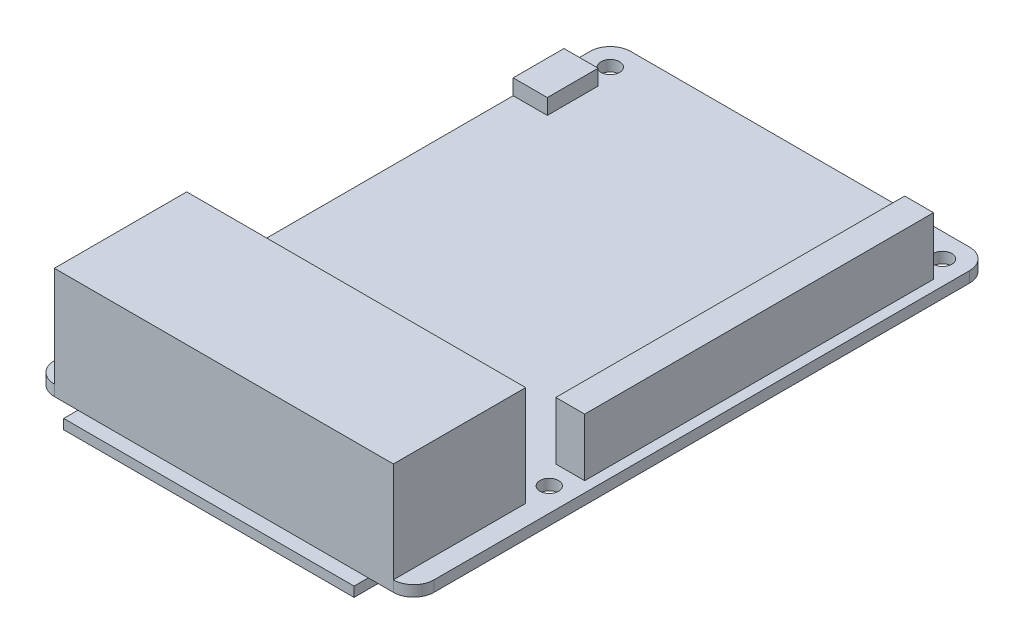
ISO-10303-21;
HEADER;
FILE_DESCRIPTION(('STEP AP214'),'2;1');
FILE_NAME('part.step','',(''),(''),'','','');
FILE_SCHEMA(('AUTOMOTIVE_DESIGN { 1 0 10303 214 1 1 1 1 }'));
ENDSEC;
DATA;
#1=APPLICATION_CONTEXT('core data for automotive mechanical design processes');
#2=APPLICATION_PROTOCOL_DEFINITION('international standard','automotive_design',2000,#1);
#3=PRODUCT_CONTEXT('',#1,'mechanical');
#4=PRODUCT('Part','Part','',(#3));
#5=PRODUCT_RELATED_PRODUCT_CATEGORY('part','',(#4));
#6=PRODUCT_DEFINITION_FORMATION('','',#4);
#7=PRODUCT_DEFINITION_CONTEXT('part definition',#1,'design');
#8=PRODUCT_DEFINITION('design','',#6,#7);
#9=PRODUCT_DEFINITION_SHAPE('','',#8);
#10=(LENGTH_UNIT() NAMED_UNIT(*) SI_UNIT(.MILLI.,.METRE.));
#11=(NAMED_UNIT(*) PLANE_ANGLE_UNIT() SI_UNIT($,.RADIAN.));
#12=(NAMED_UNIT(*) SI_UNIT($,.STERADIAN.) SOLID_ANGLE_UNIT());
#13=UNCERTAINTY_MEASURE_WITH_UNIT(LENGTH_MEASURE(1.E-05),#10,'distance_accuracy_value','');
#14=(GEOMETRIC_REPRESENTATION_CONTEXT(3) GLOBAL_UNCERTAINTY_ASSIGNED_CONTEXT((#13)) GLOBAL_UNIT_ASSIGNED_CONTEXT((#10,
#11,#12)) REPRESENTATION_CONTEXT('',''));
#15=CARTESIAN_POINT('',(0.,0.,0.));
#16=DIRECTION('',(0.,0.,1.));
#17=DIRECTION('',(1.,0.,0.));
#18=AXIS2_PLACEMENT_3D('',#15,#16,#17);
#19=CARTESIAN_POINT('',(0.,3.88620000000001,-78.1674));
#20=DIRECTION('',(1.,0.,0.));
#21=DIRECTION('',(0.,0.,-1.));
#22=AXIS2_PLACEMENT_3D('',#19,#20,#21);
#23=PLANE('',#22);
#24=DIRECTION('',(0.,0.,1.));
#25=VECTOR('',#24,1.);
#26=CARTESIAN_POINT('',(0.,1.60020000000001,-78.1674));
#27=LINE('',#26,#25);
#28=CARTESIAN_POINT('',(0.,1.60020000000001,-78.1674));
#29=VERTEX_POINT('',#28);
#30=CARTESIAN_POINT('',(0.,1.60020000000001,-70.6744));
#31=VERTEX_POINT('',#30);
#32=EDGE_CURVE('E107',#29,#31,#27,.T.);
#33=ORIENTED_EDGE('',*,*,#32,.T.);
#34=DIRECTION('',(0.,-0.999999999999999,0.));
#35=VECTOR('',#34,1.);
#36=CARTESIAN_POINT('',(0.,3.88620000000001,-70.6744));
#37=LINE('',#36,#35);
#38=CARTESIAN_POINT('',(0.,3.88620000000001,-70.6744));
#39=VERTEX_POINT('',#38);
#40=EDGE_CURVE('E12',#39,#31,#37,.T.);
#41=ORIENTED_EDGE('',*,*,#40,.F.);
#42=DIRECTION('',(0.,0.,1.));
#43=VECTOR('',#42,1.);
#44=CARTESIAN_POINT('',(0.,3.88620000000001,-78.1674));
#45=LINE('',#44,#43);
#46=CARTESIAN_POINT('',(0.,3.88620000000001,-78.1674));
#47=VERTEX_POINT('',#46);
#48=EDGE_CURVE('E95',#47,#39,#45,.T.);
#49=ORIENTED_EDGE('',*,*,#48,.F.);
#50=DIRECTION('',(0.,-0.999999999999999,0.));
#51=VECTOR('',#50,1.);
#52=CARTESIAN_POINT('',(0.,3.88620000000001,-78.1674));
#53=LINE('',#52,#51);
#54=EDGE_CURVE('E103',#47,#29,#53,.T.);
#55=ORIENTED_EDGE('',*,*,#54,.T.);
#56=EDGE_LOOP('',(#33,#41,#49,#55));
#57=FACE_BOUND('',#56,.T.);
#58=ADVANCED_FACE('F44',(#57),#23,.F.);
#59=CARTESIAN_POINT('',(0.,3.88620000000001,-70.6744));
#60=DIRECTION('',(0.,0.,-1.));
#61=DIRECTION('',(-1.,0.,0.));
#62=AXIS2_PLACEMENT_3D('',#59,#60,#61);
#63=PLANE('',#62);
#64=DIRECTION('',(1.,0.,0.));
#65=VECTOR('',#64,1.);
#66=CARTESIAN_POINT('',(0.,1.60020000000001,-70.6744));
#67=LINE('',#66,#65);
#68=CARTESIAN_POINT('',(5.03292757481331,1.60020000000001,-70.6744));
#69=VERTEX_POINT('',#68);
#70=EDGE_CURVE('E99',#31,#69,#67,.T.);
#71=ORIENTED_EDGE('',*,*,#70,.T.);
#72=DIRECTION('',(0.,-0.999999999999999,0.));
#73=VECTOR('',#72,1.);
#74=CARTESIAN_POINT('',(5.03292757481331,3.88620000000001,-70.6744));
#75=LINE('',#74,#73);
#76=CARTESIAN_POINT('',(5.03292757481331,3.88620000000001,-70.6744));
#77=VERTEX_POINT('',#76);
#78=EDGE_CURVE('E52',#77,#69,#75,.T.);
#79=ORIENTED_EDGE('',*,*,#78,.F.);
#80=DIRECTION('',(1.,0.,0.));
#81=VECTOR('',#80,1.);
#82=CARTESIAN_POINT('',(0.,3.88620000000001,-70.6744));
#83=LINE('',#82,#81);
#84=EDGE_CURVE('E90',#39,#77,#83,.T.);
#85=ORIENTED_EDGE('',*,*,#84,.F.);
#86=ORIENTED_EDGE('',*,*,#40,.T.);
#87=EDGE_LOOP('',(#71,#79,#85,#86));
#88=FACE_BOUND('',#87,.T.);
#89=ADVANCED_FACE('F98',(#88),#63,.F.);
#90=CARTESIAN_POINT('',(5.03292757481331,3.88620000000001,-78.1674));
#91=DIRECTION('',(-1.,0.,0.));
#92=DIRECTION('',(0.,0.,1.));
#93=AXIS2_PLACEMENT_3D('',#90,#91,#92);
#94=PLANE('',#93);
#95=DIRECTION('',(0.,0.,-1.));
#96=VECTOR('',#95,1.);
#97=CARTESIAN_POINT('',(5.03292757481331,1.60020000000001,-78.1674));
#98=LINE('',#97,#96);
#99=CARTESIAN_POINT('',(5.03292757481331,1.60020000000001,-78.1674));
#100=VERTEX_POINT('',#99);
#101=EDGE_CURVE('E77',#69,#100,#98,.T.);
#102=ORIENTED_EDGE('',*,*,#101,.T.);
#103=DIRECTION('',(0.,-0.999999999999999,0.));
#104=VECTOR('',#103,1.);
#105=CARTESIAN_POINT('',(5.03292757481331,3.88620000000001,-78.1674));
#106=LINE('',#105,#104);
#107=CARTESIAN_POINT('',(5.03292757481331,3.88620000000001,-78.1674));
#108=VERTEX_POINT('',#107);
#109=EDGE_CURVE('E100',#108,#100,#106,.T.);
#110=ORIENTED_EDGE('',*,*,#109,.F.);
#111=DIRECTION('',(0.,0.,-1.));
#112=VECTOR('',#111,1.);
#113=CARTESIAN_POINT('',(5.03292757481331,3.88620000000001,-78.1674));
#114=LINE('',#113,#112);
#115=EDGE_CURVE('E93',#77,#108,#114,.T.);
#116=ORIENTED_EDGE('',*,*,#115,.F.);
#117=ORIENTED_EDGE('',*,*,#78,.T.);
#118=EDGE_LOOP('',(#102,#110,#116,#117));
#119=FACE_BOUND('',#118,.T.);
#120=ADVANCED_FACE('F101',(#119),#94,.F.);
#121=CARTESIAN_POINT('',(0.,3.88620000000001,-78.1674));
#122=DIRECTION('',(0.,0.,1.));
#123=DIRECTION('',(1.,0.,0.));
#124=AXIS2_PLACEMENT_3D('',#121,#122,#123);
#125=PLANE('',#124);
#126=DIRECTION('',(-1.,0.,0.));
#127=VECTOR('',#126,1.);
#128=CARTESIAN_POINT('',(0.,1.60020000000001,-78.1674));
#129=LINE('',#128,#127);
#130=EDGE_CURVE('E83',#100,#29,#129,.T.);
#131=ORIENTED_EDGE('',*,*,#130,.T.);
#132=ORIENTED_EDGE('',*,*,#54,.F.);
#133=DIRECTION('',(-1.,0.,0.));
#134=VECTOR('',#133,1.);
#135=CARTESIAN_POINT('',(0.,3.88620000000001,-78.1674));
#136=LINE('',#135,#134);
#137=EDGE_CURVE('E60',#108,#47,#136,.T.);
#138=ORIENTED_EDGE('',*,*,#137,.F.);
#139=ORIENTED_EDGE('',*,*,#109,.T.);
#140=EDGE_LOOP('',(#131,#132,#138,#139));
#141=FACE_BOUND('',#140,.T.);
#142=ADVANCED_FACE('F114',(#141),#125,.F.);
#143=CARTESIAN_POINT('',(0.,3.88620000000001,0.));
#144=DIRECTION('',(0.,0.999999999999999,0.));
#145=DIRECTION('',(0.,0.,1.));
#146=AXIS2_PLACEMENT_3D('',#143,#144,#145);
#147=PLANE('',#146);
#148=ORIENTED_EDGE('',*,*,#48,.T.);
#149=ORIENTED_EDGE('',*,*,#84,.T.);
#150=ORIENTED_EDGE('',*,*,#115,.T.);
#151=ORIENTED_EDGE('',*,*,#137,.T.);
#152=EDGE_LOOP('',(#148,#149,#150,#151));
#153=FACE_BOUND('',#152,.T.);
#154=ADVANCED_FACE('F91',(#153),#147,.T.);
#155=CARTESIAN_POINT('',(0.,1.6002,0.));
#156=DIRECTION('',(0.,0.999999999999999,0.));
#157=DIRECTION('',(0.,0.,1.));
#158=AXIS2_PLACEMENT_3D('',#155,#156,#157);
#159=PLANE('',#158);
#160=ORIENTED_EDGE('',*,*,#32,.F.);
#161=ORIENTED_EDGE('',*,*,#130,.F.);
#162=ORIENTED_EDGE('',*,*,#101,.F.);
#163=ORIENTED_EDGE('',*,*,#70,.F.);
#164=EDGE_LOOP('',(#160,#161,#162,#163));
#165=FACE_BOUND('',#164,.T.);
#166=ADVANCED_FACE('F117',(#165),#159,.F.);
#167=CLOSED_SHELL('',(#58,#89,#120,#142,#154,#166));
#168=MANIFOLD_SOLID_BREP('B2',#167);
#169=CARTESIAN_POINT('',(2.99999999999999,1.60020000000001,-81.9999999999999));
#170=DIRECTION('',(0.,-0.999999999999999,0.));
#171=DIRECTION('',(0.,0.,-1.));
#172=AXIS2_PLACEMENT_3D('',#169,#170,#171);
#173=PLANE('',#172);
#174=DIRECTION('',(0.,0.,1.));
#175=VECTOR('',#174,1.);
#176=CARTESIAN_POINT('',(3.00000000000002,1.6002,0.));
#177=LINE('',#176,#175);
#178=CARTESIAN_POINT('',(3.00000000000002,1.60020000000001,-19.5171453212591));
#179=VERTEX_POINT('',#178);
#180=CARTESIAN_POINT('',(3.00000000000002,1.6002,0.));
#181=VERTEX_POINT('',#180);
#182=EDGE_CURVE('E363',#179,#181,#177,.T.);
#183=ORIENTED_EDGE('',*,*,#182,.F.);
#184=DIRECTION('',(-1.,0.,0.));
#185=VECTOR('',#184,1.);
#186=CARTESIAN_POINT('',(3.00000000000002,1.60020000000001,-19.5171453212591));
#187=LINE('',#186,#185);
#188=CARTESIAN_POINT('',(53.,1.6002,-19.5171453212591));
#189=VERTEX_POINT('',#188);
#190=EDGE_CURVE('E368',#189,#179,#187,.T.);
#191=ORIENTED_EDGE('',*,*,#190,.F.);
#192=DIRECTION('',(0.,0.,-1.));
#193=VECTOR('',#192,1.);
#194=CARTESIAN_POINT('',(53.,1.60020000000001,0.));
#195=LINE('',#194,#193);
#196=CARTESIAN_POINT('',(53.,1.60020000000001,0.));
#197=VERTEX_POINT('',#196);
#198=EDGE_CURVE('E377',#197,#189,#195,.T.);
#199=ORIENTED_EDGE('',*,*,#198,.F.);
#200=CARTESIAN_POINT('',(53.,1.60020000000001,-3.));
#201=DIRECTION('',(0.,0.999999999999999,0.));
#202=DIRECTION('',(0.,0.,1.));
#203=AXIS2_PLACEMENT_3D('',#200,#201,#202);
#204=CIRCLE('',#203,3.);
#205=CARTESIAN_POINT('',(56.,1.60020000000001,-3.));
#206=VERTEX_POINT('',#205);
#207=EDGE_CURVE('E426',#197,#206,#204,.T.);
#208=ORIENTED_EDGE('',*,*,#207,.T.);
#209=DIRECTION('',(0.,0.,-1.));
#210=VECTOR('',#209,1.);
#211=CARTESIAN_POINT('',(56.,1.60020000000001,-3.));
#212=LINE('',#211,#210);
#213=CARTESIAN_POINT('',(56.,1.6002,-81.9999999999999));
#214=VERTEX_POINT('',#213);
#215=EDGE_CURVE('E428',#206,#214,#212,.T.);
#216=ORIENTED_EDGE('',*,*,#215,.T.);
#217=CARTESIAN_POINT('',(53.,1.6002,-81.9999999999999));
#218=DIRECTION('',(0.,0.999999999999999,0.));
#219=DIRECTION('',(0.,0.,-1.));
#220=AXIS2_PLACEMENT_3D('',#217,#218,#219);
#221=CIRCLE('',#220,3.);
#222=CARTESIAN_POINT('',(53.,1.6002,-85.));
#223=VERTEX_POINT('',#222);
#224=EDGE_CURVE('E430',#214,#223,#221,.T.);
#225=ORIENTED_EDGE('',*,*,#224,.T.);
#226=DIRECTION('',(-1.,0.,0.));
#227=VECTOR('',#226,1.);
#228=CARTESIAN_POINT('',(2.99999999999999,1.6002,-85.));
#229=LINE('',#228,#227);
#230=CARTESIAN_POINT('',(2.99999999999999,1.6002,-85.));
#231=VERTEX_POINT('',#230);
#232=EDGE_CURVE('E432',#223,#231,#229,.T.);
#233=ORIENTED_EDGE('',*,*,#232,.T.);
#234=CARTESIAN_POINT('',(2.99999999999999,1.60020000000001,-81.9999999999999));
#235=DIRECTION('',(0.,0.999999999999999,0.));
#236=DIRECTION('',(0.,0.,-1.));
#237=AXIS2_PLACEMENT_3D('',#234,#235,#236);
#238=CIRCLE('',#237,3.);
#239=CARTESIAN_POINT('',(0.,1.60020000000001,-81.9999999999999));
#240=VERTEX_POINT('',#239);
#241=EDGE_CURVE('E418',#231,#240,#238,.T.);
#242=ORIENTED_EDGE('',*,*,#241,.T.);
#243=DIRECTION('',(0.,0.,1.));
#244=VECTOR('',#243,1.);
#245=CARTESIAN_POINT('',(0.,1.6002,-3.00000000000002));
#246=LINE('',#245,#244);
#247=CARTESIAN_POINT('',(0.,1.6002,-3.00000000000002));
#248=VERTEX_POINT('',#247);
#249=EDGE_CURVE('E421',#240,#248,#246,.T.);
#250=ORIENTED_EDGE('',*,*,#249,.T.);
#251=CARTESIAN_POINT('',(3.,1.6002,-3.));
#252=DIRECTION('',(0.,0.999999999999999,0.));
#253=DIRECTION('',(0.,0.,-1.));
#254=AXIS2_PLACEMENT_3D('',#251,#252,#253);
#255=CIRCLE('',#254,3.);
#256=EDGE_CURVE('E424',#248,#181,#255,.T.);
#257=ORIENTED_EDGE('',*,*,#256,.T.);
#258=EDGE_LOOP('',(#183,#191,#199,#208,#216,#225,#233,#242,#250,#257));
#259=FACE_BOUND('',#258,.T.);
#260=CARTESIAN_POINT('',(3.49999999999999,1.60020000000001,-81.4999999999999));
#261=DIRECTION('',(0.,0.999999999999999,0.));
#262=DIRECTION('',(0.,0.,1.));
#263=AXIS2_PLACEMENT_3D('',#260,#261,#262);
#264=CIRCLE('',#263,1.375);
#265=CARTESIAN_POINT('',(3.49999999999999,1.60020000000001,-80.1249999999999));
#266=VERTEX_POINT('',#265);
#267=EDGE_CURVE('E393',#266,#266,#264,.T.);
#268=ORIENTED_EDGE('',*,*,#267,.F.);
#269=EDGE_LOOP('',(#268));
#270=FACE_BOUND('',#269,.T.);
#271=CARTESIAN_POINT('',(3.49999999999999,1.60020000000001,-23.5));
#272=DIRECTION('',(0.,0.999999999999999,0.));
#273=DIRECTION('',(0.,0.,1.));
#274=AXIS2_PLACEMENT_3D('',#271,#272,#273);
#275=CIRCLE('',#274,1.375);
#276=CARTESIAN_POINT('',(3.49999999999999,1.60020000000001,-22.125));
#277=VERTEX_POINT('',#276);
#278=EDGE_CURVE('E399',#277,#277,#275,.T.);
#279=ORIENTED_EDGE('',*,*,#278,.F.);
#280=EDGE_LOOP('',(#279));
#281=FACE_BOUND('',#280,.T.);
#282=CARTESIAN_POINT('',(52.5,1.6002,-81.4999999999999));
#283=DIRECTION('',(0.,0.999999999999999,0.));
#284=DIRECTION('',(0.,0.,1.));
#285=AXIS2_PLACEMENT_3D('',#282,#283,#284);
#286=CIRCLE('',#285,1.375);
#287=CARTESIAN_POINT('',(52.5,1.6002,-80.1249999999999));
#288=VERTEX_POINT('',#287);
#289=EDGE_CURVE('E405',#288,#288,#286,.T.);
#290=ORIENTED_EDGE('',*,*,#289,.F.);
#291=EDGE_LOOP('',(#290));
#292=FACE_BOUND('',#291,.T.);
#293=CARTESIAN_POINT('',(52.5,1.6002,-23.5));
#294=DIRECTION('',(0.,0.999999999999999,0.));
#295=DIRECTION('',(0.,0.,1.));
#296=AXIS2_PLACEMENT_3D('',#293,#294,#295);
#297=CIRCLE('',#296,1.375);
#298=CARTESIAN_POINT('',(52.5,1.6002,-22.125));
#299=VERTEX_POINT('',#298);
#300=EDGE_CURVE('E411',#299,#299,#297,.T.);
#301=ORIENTED_EDGE('',*,*,#300,.F.);
#302=EDGE_LOOP('',(#301));
#303=FACE_BOUND('',#302,.T.);
#304=DIRECTION('',(0.,0.,-0.999999999999999));
#305=VECTOR('',#304,1.);
#306=CARTESIAN_POINT('',(54.4480020123617,1.6002,-26.7705763978723));
#307=LINE('',#306,#305);
#308=CARTESIAN_POINT('',(54.4480020123617,1.6002,-26.7705763978723));
#309=VERTEX_POINT('',#308);
#310=CARTESIAN_POINT('',(54.4480020123617,1.6002,-78.2268075319821));
#311=VERTEX_POINT('',#310);
#312=EDGE_CURVE('E326',#309,#311,#307,.T.);
#313=ORIENTED_EDGE('',*,*,#312,.F.);
#314=DIRECTION('',(1.,0.,0.));
#315=VECTOR('',#314,1.);
#316=CARTESIAN_POINT('',(54.4480020123617,1.6002,-26.7705763978723));
#317=LINE('',#316,#315);
#318=CARTESIAN_POINT('',(50.191282161852,1.6002,-26.7705763978723));
#319=VERTEX_POINT('',#318);
#320=EDGE_CURVE('E323',#319,#309,#317,.T.);
#321=ORIENTED_EDGE('',*,*,#320,.F.);
#322=DIRECTION('',(0.,0.,0.999999999999999));
#323=VECTOR('',#322,1.);
#324=CARTESIAN_POINT('',(50.191282161852,1.6002,-26.7705763978723));
#325=LINE('',#324,#323);
#326=CARTESIAN_POINT('',(50.191282161852,1.6002,-78.2268075319821));
#327=VERTEX_POINT('',#326);
#328=EDGE_CURVE('E189',#327,#319,#325,.T.);
#329=ORIENTED_EDGE('',*,*,#328,.F.);
#330=DIRECTION('',(-1.,0.,0.));
#331=VECTOR('',#330,1.);
#332=CARTESIAN_POINT('',(54.4480020123617,1.6002,-78.2268075319821));
#333=LINE('',#332,#331);
#334=EDGE_CURVE('E184',#311,#327,#333,.T.);
#335=ORIENTED_EDGE('',*,*,#334,.F.);
#336=EDGE_LOOP('',(#313,#321,#329,#335));
#337=FACE_BOUND('',#336,.T.);
#338=ADVANCED_FACE('F167',(#259,#270,#281,#292,#303,#337),#173,.F.);
#339=CARTESIAN_POINT('',(2.99999999999999,1.60020000000001,-81.9999999999999));
#340=DIRECTION('',(0.,-0.999999999999999,0.));
#341=DIRECTION('',(0.,0.,-1.));
#342=AXIS2_PLACEMENT_3D('',#339,#340,#341);
#343=CYLINDRICAL_SURFACE('',#342,3.);
#344=CARTESIAN_POINT('',(2.99999999999999,0.,-81.9999999999999));
#345=DIRECTION('',(0.,0.999999999999999,0.));
#346=DIRECTION('',(0.,0.,-1.));
#347=AXIS2_PLACEMENT_3D('',#344,#345,#346);
#348=CIRCLE('',#347,3.);
#349=CARTESIAN_POINT('',(2.99999999999999,0.,-85.));
#350=VERTEX_POINT('',#349);
#351=CARTESIAN_POINT('',(0.,0.,-81.9999999999999));
#352=VERTEX_POINT('',#351);
#353=EDGE_CURVE('E417',#350,#352,#348,.T.);
#354=ORIENTED_EDGE('',*,*,#353,.T.);
#355=DIRECTION('',(0.,-0.999999999999999,0.));
#356=VECTOR('',#355,1.);
#357=CARTESIAN_POINT('',(0.,1.60020000000001,-81.9999999999999));
#358=LINE('',#357,#356);
#359=EDGE_CURVE('E171',#240,#352,#358,.T.);
#360=ORIENTED_EDGE('',*,*,#359,.F.);
#361=ORIENTED_EDGE('',*,*,#241,.F.);
#362=DIRECTION('',(0.,-0.999999999999999,0.));
#363=VECTOR('',#362,1.);
#364=CARTESIAN_POINT('',(2.99999999999999,1.6002,-85.));
#365=LINE('',#364,#363);
#366=EDGE_CURVE('E434',#231,#350,#365,.T.);
#367=ORIENTED_EDGE('',*,*,#366,.T.);
#368=EDGE_LOOP('',(#354,#360,#361,#367));
#369=FACE_BOUND('',#368,.T.);
#370=ADVANCED_FACE('F169',(#369),#343,.T.);
#371=CARTESIAN_POINT('',(0.,1.6002,-3.00000000000002));
#372=DIRECTION('',(1.,0.,0.));
#373=DIRECTION('',(0.,0.,-1.));
#374=AXIS2_PLACEMENT_3D('',#371,#372,#373);
#375=PLANE('',#374);
#376=DIRECTION('',(0.,0.,1.));
#377=VECTOR('',#376,1.);
#378=CARTESIAN_POINT('',(0.,0.,-3.00000000000002));
#379=LINE('',#378,#377);
#380=CARTESIAN_POINT('',(0.,0.,-3.00000000000002));
#381=VERTEX_POINT('',#380);
#382=EDGE_CURVE('E437',#352,#381,#379,.T.);
#383=ORIENTED_EDGE('',*,*,#382,.T.);
#384=DIRECTION('',(0.,-0.999999999999999,0.));
#385=VECTOR('',#384,1.);
#386=CARTESIAN_POINT('',(0.,1.6002,-3.00000000000002));
#387=LINE('',#386,#385);
#388=EDGE_CURVE('E469',#248,#381,#387,.T.);
#389=ORIENTED_EDGE('',*,*,#388,.F.);
#390=ORIENTED_EDGE('',*,*,#249,.F.);
#391=ORIENTED_EDGE('',*,*,#359,.T.);
#392=EDGE_LOOP('',(#383,#389,#390,#391));
#393=FACE_BOUND('',#392,.T.);
#394=ADVANCED_FACE('F478',(#393),#375,.F.);
#395=CARTESIAN_POINT('',(3.,1.6002,-3.));
#396=DIRECTION('',(0.,-0.999999999999999,0.));
#397=DIRECTION('',(0.,0.,-1.));
#398=AXIS2_PLACEMENT_3D('',#395,#396,#397);
#399=CYLINDRICAL_SURFACE('',#398,3.);
#400=CARTESIAN_POINT('',(3.,0.,-3.));
#401=DIRECTION('',(0.,0.999999999999999,0.));
#402=DIRECTION('',(0.,0.,-1.));
#403=AXIS2_PLACEMENT_3D('',#400,#401,#402);
#404=CIRCLE('',#403,3.);
#405=CARTESIAN_POINT('',(3.00000000000002,0.,0.));
#406=VERTEX_POINT('',#405);
#407=EDGE_CURVE('E439',#381,#406,#404,.T.);
#408=ORIENTED_EDGE('',*,*,#407,.T.);
#409=DIRECTION('',(0.,-0.999999999999999,0.));
#410=VECTOR('',#409,1.);
#411=CARTESIAN_POINT('',(3.00000000000002,1.6002,0.));
#412=LINE('',#411,#410);
#413=EDGE_CURVE('E467',#181,#406,#412,.T.);
#414=ORIENTED_EDGE('',*,*,#413,.F.);
#415=ORIENTED_EDGE('',*,*,#256,.F.);
#416=ORIENTED_EDGE('',*,*,#388,.T.);
#417=EDGE_LOOP('',(#408,#414,#415,#416));
#418=FACE_BOUND('',#417,.T.);
#419=ADVANCED_FACE('F490',(#418),#399,.T.);
#420=CARTESIAN_POINT('',(3.00000000000002,1.6002,0.));
#421=DIRECTION('',(0.,0.,-1.));
#422=DIRECTION('',(-1.,0.,0.));
#423=AXIS2_PLACEMENT_3D('',#420,#421,#422);
#424=PLANE('',#423);
#425=DIRECTION('',(1.,0.,0.));
#426=VECTOR('',#425,1.);
#427=CARTESIAN_POINT('',(3.00000000000002,0.,0.));
#428=LINE('',#427,#426);
#429=CARTESIAN_POINT('',(6.46826940659455,0.,0.));
#430=VERTEX_POINT('',#429);
#431=EDGE_CURVE('E442',#406,#430,#428,.T.);
#432=ORIENTED_EDGE('',*,*,#431,.T.);
#433=CARTESIAN_POINT('',(49.3032950653712,0.,0.));
#434=VERTEX_POINT('',#433);
#435=EDGE_CURVE('E446',#430,#434,#428,.T.);
#436=ORIENTED_EDGE('',*,*,#435,.T.);
#437=CARTESIAN_POINT('',(53.,0.,0.));
#438=VERTEX_POINT('',#437);
#439=EDGE_CURVE('E441',#434,#438,#428,.T.);
#440=ORIENTED_EDGE('',*,*,#439,.T.);
#441=DIRECTION('',(0.,-0.999999999999999,0.));
#442=VECTOR('',#441,1.);
#443=CARTESIAN_POINT('',(53.,1.60020000000001,0.));
#444=LINE('',#443,#442);
#445=EDGE_CURVE('E464',#197,#438,#444,.T.);
#446=ORIENTED_EDGE('',*,*,#445,.F.);
#447=DIRECTION('',(0.,-0.999999999999999,0.));
#448=VECTOR('',#447,1.);
#449=CARTESIAN_POINT('',(53.,16.4002,0.));
#450=LINE('',#449,#448);
#451=CARTESIAN_POINT('',(53.,16.4002,0.));
#452=VERTEX_POINT('',#451);
#453=EDGE_CURVE('E387',#452,#197,#450,.T.);
#454=ORIENTED_EDGE('',*,*,#453,.F.);
#455=DIRECTION('',(1.,0.,0.));
#456=VECTOR('',#455,1.);
#457=CARTESIAN_POINT('',(3.00000000000002,16.4002,0.));
#458=LINE('',#457,#456);
#459=CARTESIAN_POINT('',(3.00000000000002,16.4002,0.));
#460=VERTEX_POINT('',#459);
#461=EDGE_CURVE('E367',#460,#452,#458,.T.);
#462=ORIENTED_EDGE('',*,*,#461,.F.);
#463=DIRECTION('',(0.,-0.999999999999999,0.));
#464=VECTOR('',#463,1.);
#465=CARTESIAN_POINT('',(3.00000000000002,16.4002,0.));
#466=LINE('',#465,#464);
#467=EDGE_CURVE('E390',#460,#181,#466,.T.);
#468=ORIENTED_EDGE('',*,*,#467,.T.);
#469=ORIENTED_EDGE('',*,*,#413,.T.);
#470=EDGE_LOOP('',(#432,#436,#440,#446,#454,#462,#468,#469));
#471=FACE_BOUND('',#470,.T.);
#472=ADVANCED_FACE('F492',(#471),#424,.F.);
#473=CARTESIAN_POINT('',(53.,1.60020000000001,-3.));
#474=DIRECTION('',(0.,-0.999999999999999,0.));
#475=DIRECTION('',(0.,0.,-1.));
#476=AXIS2_PLACEMENT_3D('',#473,#474,#475);
#477=CYLINDRICAL_SURFACE('',#476,3.);
#478=CARTESIAN_POINT('',(53.,0.,-3.));
#479=DIRECTION('',(0.,0.999999999999999,0.));
#480=DIRECTION('',(0.,0.,1.));
#481=AXIS2_PLACEMENT_3D('',#478,#479,#480);
#482=CIRCLE('',#481,3.);
#483=CARTESIAN_POINT('',(56.,0.,-3.));
#484=VERTEX_POINT('',#483);
#485=EDGE_CURVE('E445',#438,#484,#482,.T.);
#486=ORIENTED_EDGE('',*,*,#485,.T.);
#487=DIRECTION('',(0.,-0.999999999999999,0.));
#488=VECTOR('',#487,1.);
#489=CARTESIAN_POINT('',(56.,1.60020000000001,-3.));
#490=LINE('',#489,#488);
#491=EDGE_CURVE('E461',#206,#484,#490,.T.);
#492=ORIENTED_EDGE('',*,*,#491,.F.);
#493=ORIENTED_EDGE('',*,*,#207,.F.);
#494=ORIENTED_EDGE('',*,*,#445,.T.);
#495=EDGE_LOOP('',(#486,#492,#493,#494));
#496=FACE_BOUND('',#495,.T.);
#497=ADVANCED_FACE('F515',(#496),#477,.T.);
#498=CARTESIAN_POINT('',(56.,1.60020000000001,-3.));
#499=DIRECTION('',(-1.,0.,0.));
#500=DIRECTION('',(0.,0.,1.));
#501=AXIS2_PLACEMENT_3D('',#498,#499,#500);
#502=PLANE('',#501);
#503=DIRECTION('',(0.,0.,-1.));
#504=VECTOR('',#503,1.);
#505=CARTESIAN_POINT('',(56.,0.,-3.));
#506=LINE('',#505,#504);
#507=CARTESIAN_POINT('',(56.,0.,-81.9999999999999));
#508=VERTEX_POINT('',#507);
#509=EDGE_CURVE('E448',#484,#508,#506,.T.);
#510=ORIENTED_EDGE('',*,*,#509,.T.);
#511=DIRECTION('',(0.,-0.999999999999999,0.));
#512=VECTOR('',#511,1.);
#513=CARTESIAN_POINT('',(56.,1.6002,-81.9999999999999));
#514=LINE('',#513,#512);
#515=EDGE_CURVE('E458',#214,#508,#514,.T.);
#516=ORIENTED_EDGE('',*,*,#515,.F.);
#517=ORIENTED_EDGE('',*,*,#215,.F.);
#518=ORIENTED_EDGE('',*,*,#491,.T.);
#519=EDGE_LOOP('',(#510,#516,#517,#518));
#520=FACE_BOUND('',#519,.T.);
#521=ADVANCED_FACE('F520',(#520),#502,.F.);
#522=CARTESIAN_POINT('',(53.,1.6002,-81.9999999999999));
#523=DIRECTION('',(0.,-0.999999999999999,0.));
#524=DIRECTION('',(0.,0.,-1.));
#525=AXIS2_PLACEMENT_3D('',#522,#523,#524);
#526=CYLINDRICAL_SURFACE('',#525,3.);
#527=CARTESIAN_POINT('',(53.,0.,-81.9999999999999));
#528=DIRECTION('',(0.,0.999999999999999,0.));
#529=DIRECTION('',(0.,0.,-1.));
#530=AXIS2_PLACEMENT_3D('',#527,#528,#529);
#531=CIRCLE('',#530,3.);
#532=CARTESIAN_POINT('',(53.,0.,-85.));
#533=VERTEX_POINT('',#532);
#534=EDGE_CURVE('E450',#508,#533,#531,.T.);
#535=ORIENTED_EDGE('',*,*,#534,.T.);
#536=DIRECTION('',(0.,-0.999999999999999,0.));
#537=VECTOR('',#536,1.);
#538=CARTESIAN_POINT('',(53.,1.6002,-85.));
#539=LINE('',#538,#537);
#540=EDGE_CURVE('E455',#223,#533,#539,.T.);
#541=ORIENTED_EDGE('',*,*,#540,.F.);
#542=ORIENTED_EDGE('',*,*,#224,.F.);
#543=ORIENTED_EDGE('',*,*,#515,.T.);
#544=EDGE_LOOP('',(#535,#541,#542,#543));
#545=FACE_BOUND('',#544,.T.);
#546=ADVANCED_FACE('F525',(#545),#526,.T.);
#547=CARTESIAN_POINT('',(2.99999999999999,1.6002,-85.));
#548=DIRECTION('',(0.,0.,1.));
#549=DIRECTION('',(1.,0.,0.));
#550=AXIS2_PLACEMENT_3D('',#547,#548,#549);
#551=PLANE('',#550);
#552=DIRECTION('',(-1.,0.,0.));
#553=VECTOR('',#552,1.);
#554=CARTESIAN_POINT('',(2.99999999999999,0.,-85.));
#555=LINE('',#554,#553);
#556=EDGE_CURVE('E422',#533,#350,#555,.T.);
#557=ORIENTED_EDGE('',*,*,#556,.T.);
#558=ORIENTED_EDGE('',*,*,#366,.F.);
#559=ORIENTED_EDGE('',*,*,#232,.F.);
#560=ORIENTED_EDGE('',*,*,#540,.T.);
#561=EDGE_LOOP('',(#557,#558,#559,#560));
#562=FACE_BOUND('',#561,.T.);
#563=ADVANCED_FACE('F527',(#562),#551,.F.);
#564=CARTESIAN_POINT('',(2.99999999999999,0.,-81.9999999999999));
#565=DIRECTION('',(0.,-0.999999999999999,0.));
#566=DIRECTION('',(0.,0.,-1.));
#567=AXIS2_PLACEMENT_3D('',#564,#565,#566);
#568=PLANE('',#567);
#569=DIRECTION('',(0.,0.,-1.));
#570=VECTOR('',#569,1.);
#571=CARTESIAN_POINT('',(6.46826940659454,0.,-80.1435865954223));
#572=LINE('',#571,#570);
#573=CARTESIAN_POINT('',(6.46826940659454,0.,-80.1435865954223));
#574=VERTEX_POINT('',#573);
#575=EDGE_CURVE('E42',#430,#574,#572,.T.);
#576=ORIENTED_EDGE('',*,*,#575,.F.);
#577=ORIENTED_EDGE('',*,*,#431,.F.);
#578=ORIENTED_EDGE('',*,*,#407,.F.);
#579=ORIENTED_EDGE('',*,*,#382,.F.);
#580=ORIENTED_EDGE('',*,*,#353,.F.);
#581=ORIENTED_EDGE('',*,*,#556,.F.);
#582=ORIENTED_EDGE('',*,*,#534,.F.);
#583=ORIENTED_EDGE('',*,*,#509,.F.);
#584=ORIENTED_EDGE('',*,*,#485,.F.);
#585=ORIENTED_EDGE('',*,*,#439,.F.);
#586=DIRECTION('',(0.,0.,1.));
#587=VECTOR('',#586,1.);
#588=CARTESIAN_POINT('',(49.3032950653712,0.,-80.1435865954223));
#589=LINE('',#588,#587);
#590=CARTESIAN_POINT('',(49.3032950653712,0.,-80.1435865954223));
#591=VERTEX_POINT('',#590);
#592=EDGE_CURVE('E348',#591,#434,#589,.T.);
#593=ORIENTED_EDGE('',*,*,#592,.F.);
#594=DIRECTION('',(1.,0.,0.));
#595=VECTOR('',#594,1.);
#596=CARTESIAN_POINT('',(6.46826940659454,0.,-80.1435865954223));
#597=LINE('',#596,#595);
#598=EDGE_CURVE('E329',#574,#591,#597,.T.);
#599=ORIENTED_EDGE('',*,*,#598,.F.);
#600=EDGE_LOOP('',(#576,#577,#578,#579,#580,#581,#582,#583,#584,#585,#593,#599));
#601=FACE_BOUND('',#600,.T.);
#602=CARTESIAN_POINT('',(3.49999999999999,0.,-81.4999999999999));
#603=DIRECTION('',(0.,0.999999999999999,0.));
#604=DIRECTION('',(0.,0.,1.));
#605=AXIS2_PLACEMENT_3D('',#602,#603,#604);
#606=CIRCLE('',#605,1.375);
#607=CARTESIAN_POINT('',(3.49999999999999,0.,-80.1249999999999));
#608=VERTEX_POINT('',#607);
#609=EDGE_CURVE('E396',#608,#608,#606,.T.);
#610=ORIENTED_EDGE('',*,*,#609,.T.);
#611=EDGE_LOOP('',(#610));
#612=FACE_BOUND('',#611,.T.);
#613=CARTESIAN_POINT('',(3.49999999999999,0.,-23.5));
#614=DIRECTION('',(0.,0.999999999999999,0.));
#615=DIRECTION('',(0.,0.,1.));
#616=AXIS2_PLACEMENT_3D('',#613,#614,#615);
#617=CIRCLE('',#616,1.375);
#618=CARTESIAN_POINT('',(3.49999999999999,0.,-22.125));
#619=VERTEX_POINT('',#618);
#620=EDGE_CURVE('E402',#619,#619,#617,.T.);
#621=ORIENTED_EDGE('',*,*,#620,.T.);
#622=EDGE_LOOP('',(#621));
#623=FACE_BOUND('',#622,.T.);
#624=CARTESIAN_POINT('',(52.5,0.,-81.4999999999999));
#625=DIRECTION('',(0.,0.999999999999999,0.));
#626=DIRECTION('',(0.,0.,1.));
#627=AXIS2_PLACEMENT_3D('',#624,#625,#626);
#628=CIRCLE('',#627,1.375);
#629=CARTESIAN_POINT('',(52.5,0.,-80.1249999999999));
#630=VERTEX_POINT('',#629);
#631=EDGE_CURVE('E408',#630,#630,#628,.T.);
#632=ORIENTED_EDGE('',*,*,#631,.T.);
#633=EDGE_LOOP('',(#632));
#634=FACE_BOUND('',#633,.T.);
#635=CARTESIAN_POINT('',(52.5,0.,-23.5));
#636=DIRECTION('',(0.,0.999999999999999,0.));
#637=DIRECTION('',(0.,0.,1.));
#638=AXIS2_PLACEMENT_3D('',#635,#636,#637);
#639=CIRCLE('',#638,1.375);
#640=CARTESIAN_POINT('',(52.5,0.,-22.125));
#641=VERTEX_POINT('',#640);
#642=EDGE_CURVE('E414',#641,#641,#639,.T.);
#643=ORIENTED_EDGE('',*,*,#642,.T.);
#644=EDGE_LOOP('',(#643));
#645=FACE_BOUND('',#644,.T.);
#646=ADVANCED_FACE('F485',(#601,#612,#623,#634,#645),#568,.T.);
#647=CARTESIAN_POINT('',(52.5,1.6002,-23.5));
#648=DIRECTION('',(0.,0.999999999999999,0.));
#649=DIRECTION('',(0.,0.,1.));
#650=AXIS2_PLACEMENT_3D('',#647,#648,#649);
#651=CYLINDRICAL_SURFACE('',#650,1.375);
#652=ORIENTED_EDGE('',*,*,#642,.F.);
#653=EDGE_LOOP('',(#652));
#654=FACE_BOUND('',#653,.T.);
#655=ORIENTED_EDGE('',*,*,#300,.T.);
#656=EDGE_LOOP('',(#655));
#657=FACE_BOUND('',#656,.T.);
#658=ADVANCED_FACE('F534',(#654,#657),#651,.F.);
#659=CARTESIAN_POINT('',(52.5,1.6002,-81.4999999999999));
#660=DIRECTION('',(0.,0.999999999999999,0.));
#661=DIRECTION('',(0.,0.,1.));
#662=AXIS2_PLACEMENT_3D('',#659,#660,#661);
#663=CYLINDRICAL_SURFACE('',#662,1.375);
#664=ORIENTED_EDGE('',*,*,#631,.F.);
#665=EDGE_LOOP('',(#664));
#666=FACE_BOUND('',#665,.T.);
#667=ORIENTED_EDGE('',*,*,#289,.T.);
#668=EDGE_LOOP('',(#667));
#669=FACE_BOUND('',#668,.T.);
#670=ADVANCED_FACE('F545',(#666,#669),#663,.F.);
#671=CARTESIAN_POINT('',(3.49999999999999,1.60020000000001,-23.5));
#672=DIRECTION('',(0.,0.999999999999999,0.));
#673=DIRECTION('',(0.,0.,1.));
#674=AXIS2_PLACEMENT_3D('',#671,#672,#673);
#675=CYLINDRICAL_SURFACE('',#674,1.375);
#676=ORIENTED_EDGE('',*,*,#620,.F.);
#677=EDGE_LOOP('',(#676));
#678=FACE_BOUND('',#677,.T.);
#679=ORIENTED_EDGE('',*,*,#278,.T.);
#680=EDGE_LOOP('',(#679));
#681=FACE_BOUND('',#680,.T.);
#682=ADVANCED_FACE('F549',(#678,#681),#675,.F.);
#683=CARTESIAN_POINT('',(3.49999999999999,1.60020000000001,-81.4999999999999));
#684=DIRECTION('',(0.,0.999999999999999,0.));
#685=DIRECTION('',(0.,0.,1.));
#686=AXIS2_PLACEMENT_3D('',#683,#684,#685);
#687=CYLINDRICAL_SURFACE('',#686,1.375);
#688=ORIENTED_EDGE('',*,*,#609,.F.);
#689=EDGE_LOOP('',(#688));
#690=FACE_BOUND('',#689,.T.);
#691=ORIENTED_EDGE('',*,*,#267,.T.);
#692=EDGE_LOOP('',(#691));
#693=FACE_BOUND('',#692,.T.);
#694=ADVANCED_FACE('F553',(#690,#693),#687,.F.);
#695=CARTESIAN_POINT('',(3.00000000000002,16.4002,0.));
#696=DIRECTION('',(1.,0.,0.));
#697=DIRECTION('',(0.,0.,-1.));
#698=AXIS2_PLACEMENT_3D('',#695,#696,#697);
#699=PLANE('',#698);
#700=ORIENTED_EDGE('',*,*,#182,.T.);
#701=ORIENTED_EDGE('',*,*,#467,.F.);
#702=DIRECTION('',(0.,0.,1.));
#703=VECTOR('',#702,1.);
#704=CARTESIAN_POINT('',(3.00000000000002,16.4002,0.));
#705=LINE('',#704,#703);
#706=CARTESIAN_POINT('',(3.00000000000001,16.4002,-19.5171453212591));
#707=VERTEX_POINT('',#706);
#708=EDGE_CURVE('E364',#707,#460,#705,.T.);
#709=ORIENTED_EDGE('',*,*,#708,.F.);
#710=DIRECTION('',(0.,-0.999999999999999,0.));
#711=VECTOR('',#710,1.);
#712=CARTESIAN_POINT('',(3.00000000000001,16.4002,-19.5171453212591));
#713=LINE('',#712,#711);
#714=EDGE_CURVE('E374',#707,#179,#713,.T.);
#715=ORIENTED_EDGE('',*,*,#714,.T.);
#716=EDGE_LOOP('',(#700,#701,#709,#715));
#717=FACE_BOUND('',#716,.T.);
#718=ADVANCED_FACE('F499',(#717),#699,.F.);
#719=CARTESIAN_POINT('',(53.,16.4002,0.));
#720=DIRECTION('',(-1.,0.,0.));
#721=DIRECTION('',(0.,0.,1.));
#722=AXIS2_PLACEMENT_3D('',#719,#720,#721);
#723=PLANE('',#722);
#724=ORIENTED_EDGE('',*,*,#198,.T.);
#725=DIRECTION('',(0.,-0.999999999999999,0.));
#726=VECTOR('',#725,1.);
#727=CARTESIAN_POINT('',(53.,16.4002,-19.5171453212591));
#728=LINE('',#727,#726);
#729=CARTESIAN_POINT('',(53.,16.4002,-19.5171453212591));
#730=VERTEX_POINT('',#729);
#731=EDGE_CURVE('E384',#730,#189,#728,.T.);
#732=ORIENTED_EDGE('',*,*,#731,.F.);
#733=DIRECTION('',(0.,0.,-1.));
#734=VECTOR('',#733,1.);
#735=CARTESIAN_POINT('',(53.,16.4002,0.));
#736=LINE('',#735,#734);
#737=EDGE_CURVE('E370',#452,#730,#736,.T.);
#738=ORIENTED_EDGE('',*,*,#737,.F.);
#739=ORIENTED_EDGE('',*,*,#453,.T.);
#740=EDGE_LOOP('',(#724,#732,#738,#739));
#741=FACE_BOUND('',#740,.T.);
#742=ADVANCED_FACE('F509',(#741),#723,.F.);
#743=CARTESIAN_POINT('',(3.00000000000001,16.4002,-19.5171453212591));
#744=DIRECTION('',(0.,0.,1.));
#745=DIRECTION('',(1.,0.,0.));
#746=AXIS2_PLACEMENT_3D('',#743,#744,#745);
#747=PLANE('',#746);
#748=ORIENTED_EDGE('',*,*,#190,.T.);
#749=ORIENTED_EDGE('',*,*,#714,.F.);
#750=DIRECTION('',(-1.,0.,0.));
#751=VECTOR('',#750,1.);
#752=CARTESIAN_POINT('',(3.00000000000001,16.4002,-19.5171453212591));
#753=LINE('',#752,#751);
#754=EDGE_CURVE('E372',#730,#707,#753,.T.);
#755=ORIENTED_EDGE('',*,*,#754,.F.);
#756=ORIENTED_EDGE('',*,*,#731,.T.);
#757=EDGE_LOOP('',(#748,#749,#755,#756));
#758=FACE_BOUND('',#757,.T.);
#759=ADVANCED_FACE('F504',(#758),#747,.F.);
#760=CARTESIAN_POINT('',(0.,16.4002,0.));
#761=DIRECTION('',(0.,-0.999999999999999,0.));
#762=DIRECTION('',(0.,0.,-1.));
#763=AXIS2_PLACEMENT_3D('',#760,#761,#762);
#764=PLANE('',#763);
#765=ORIENTED_EDGE('',*,*,#708,.T.);
#766=ORIENTED_EDGE('',*,*,#461,.T.);
#767=ORIENTED_EDGE('',*,*,#737,.T.);
#768=ORIENTED_EDGE('',*,*,#754,.T.);
#769=EDGE_LOOP('',(#765,#766,#767,#768));
#770=FACE_BOUND('',#769,.T.);
#771=ADVANCED_FACE('F564',(#770),#764,.F.);
#772=CARTESIAN_POINT('',(0.,0.,0.));
#773=DIRECTION('',(0.,0.999999999999999,0.));
#774=DIRECTION('',(0.,0.,1.));
#775=AXIS2_PLACEMENT_3D('',#772,#773,#774);
#776=PLANE('',#775);
#777=ORIENTED_EDGE('',*,*,#435,.F.);
#778=CARTESIAN_POINT('',(6.46826940659454,0.,2.09999999999999));
#779=VERTEX_POINT('',#778);
#780=EDGE_CURVE('E177',#779,#430,#572,.T.);
#781=ORIENTED_EDGE('',*,*,#780,.F.);
#782=DIRECTION('',(-1.,0.,0.));
#783=VECTOR('',#782,1.);
#784=CARTESIAN_POINT('',(6.46826940659454,0.,2.09999999999999));
#785=LINE('',#784,#783);
#786=CARTESIAN_POINT('',(49.3032950653712,0.,2.09999999999999));
#787=VERTEX_POINT('',#786);
#788=EDGE_CURVE('E338',#787,#779,#785,.T.);
#789=ORIENTED_EDGE('',*,*,#788,.F.);
#790=EDGE_CURVE('E347',#434,#787,#589,.T.);
#791=ORIENTED_EDGE('',*,*,#790,.F.);
#792=EDGE_LOOP('',(#777,#781,#789,#791));
#793=FACE_BOUND('',#792,.T.);
#794=ADVANCED_FACE('F567',(#793),#776,.T.);
#795=CARTESIAN_POINT('',(6.46826940659453,-1.44779999999997,-80.1435865954223));
#796=DIRECTION('',(1.,0.,0.));
#797=DIRECTION('',(0.,0.,-1.));
#798=AXIS2_PLACEMENT_3D('',#795,#796,#797);
#799=PLANE('',#798);
#800=ORIENTED_EDGE('',*,*,#780,.T.);
#801=ORIENTED_EDGE('',*,*,#575,.T.);
#802=DIRECTION('',(0.,0.999999999999999,0.));
#803=VECTOR('',#802,1.);
#804=CARTESIAN_POINT('',(6.46826940659453,-1.44779999999997,-80.1435865954223));
#805=LINE('',#804,#803);
#806=CARTESIAN_POINT('',(6.46826940659453,-1.44779999999997,-80.1435865954223));
#807=VERTEX_POINT('',#806);
#808=EDGE_CURVE('E360',#807,#574,#805,.T.);
#809=ORIENTED_EDGE('',*,*,#808,.F.);
#810=DIRECTION('',(0.,0.,-1.));
#811=VECTOR('',#810,1.);
#812=CARTESIAN_POINT('',(6.46826940659453,-1.44779999999997,-80.1435865954223));
#813=LINE('',#812,#811);
#814=CARTESIAN_POINT('',(6.46826940659453,-1.4478,2.09999999999999));
#815=VERTEX_POINT('',#814);
#816=EDGE_CURVE('E334',#815,#807,#813,.T.);
#817=ORIENTED_EDGE('',*,*,#816,.F.);
#818=DIRECTION('',(0.,0.999999999999999,0.));
#819=VECTOR('',#818,1.);
#820=CARTESIAN_POINT('',(6.46826940659453,-1.4478,2.09999999999999));
#821=LINE('',#820,#819);
#822=EDGE_CURVE('E343',#815,#779,#821,.T.);
#823=ORIENTED_EDGE('',*,*,#822,.T.);
#824=EDGE_LOOP('',(#800,#801,#809,#817,#823));
#825=FACE_BOUND('',#824,.T.);
#826=ADVANCED_FACE('F569',(#825),#799,.F.);
#827=CARTESIAN_POINT('',(6.46826940659453,-1.44779999999997,-80.1435865954223));
#828=DIRECTION('',(0.,0.,1.));
#829=DIRECTION('',(1.,0.,0.));
#830=AXIS2_PLACEMENT_3D('',#827,#828,#829);
#831=PLANE('',#830);
#832=ORIENTED_EDGE('',*,*,#598,.T.);
#833=DIRECTION('',(0.,0.999999999999999,0.));
#834=VECTOR('',#833,1.);
#835=CARTESIAN_POINT('',(49.3032950653712,-1.4478,-80.1435865954223));
#836=LINE('',#835,#834);
#837=CARTESIAN_POINT('',(49.3032950653712,-1.4478,-80.1435865954223));
#838=VERTEX_POINT('',#837);
#839=EDGE_CURVE('E357',#838,#591,#836,.T.);
#840=ORIENTED_EDGE('',*,*,#839,.F.);
#841=DIRECTION('',(1.,0.,0.));
#842=VECTOR('',#841,1.);
#843=CARTESIAN_POINT('',(6.46826940659453,-1.44779999999997,-80.1435865954223));
#844=LINE('',#843,#842);
#845=EDGE_CURVE('E337',#807,#838,#844,.T.);
#846=ORIENTED_EDGE('',*,*,#845,.F.);
#847=ORIENTED_EDGE('',*,*,#808,.T.);
#848=EDGE_LOOP('',(#832,#840,#846,#847));
#849=FACE_BOUND('',#848,.T.);
#850=ADVANCED_FACE('F572',(#849),#831,.F.);
#851=CARTESIAN_POINT('',(49.3032950653712,-1.4478,-80.1435865954223));
#852=DIRECTION('',(-1.,0.,0.));
#853=DIRECTION('',(0.,0.,1.));
#854=AXIS2_PLACEMENT_3D('',#851,#852,#853);
#855=PLANE('',#854);
#856=ORIENTED_EDGE('',*,*,#592,.T.);
#857=ORIENTED_EDGE('',*,*,#790,.T.);
#858=DIRECTION('',(0.,0.999999999999999,0.));
#859=VECTOR('',#858,1.);
#860=CARTESIAN_POINT('',(49.3032950653712,-1.4478,2.09999999999999));
#861=LINE('',#860,#859);
#862=CARTESIAN_POINT('',(49.3032950653712,-1.4478,2.09999999999999));
#863=VERTEX_POINT('',#862);
#864=EDGE_CURVE('E354',#863,#787,#861,.T.);
#865=ORIENTED_EDGE('',*,*,#864,.F.);
#866=DIRECTION('',(0.,0.,1.));
#867=VECTOR('',#866,1.);
#868=CARTESIAN_POINT('',(49.3032950653712,-1.4478,-80.1435865954223));
#869=LINE('',#868,#867);
#870=EDGE_CURVE('E340',#838,#863,#869,.T.);
#871=ORIENTED_EDGE('',*,*,#870,.F.);
#872=ORIENTED_EDGE('',*,*,#839,.T.);
#873=EDGE_LOOP('',(#856,#857,#865,#871,#872));
#874=FACE_BOUND('',#873,.T.);
#875=ADVANCED_FACE('F576',(#874),#855,.F.);
#876=CARTESIAN_POINT('',(6.46826940659453,-1.4478,2.09999999999999));
#877=DIRECTION('',(0.,0.,-1.));
#878=DIRECTION('',(-1.,0.,0.));
#879=AXIS2_PLACEMENT_3D('',#876,#877,#878);
#880=PLANE('',#879);
#881=ORIENTED_EDGE('',*,*,#788,.T.);
#882=ORIENTED_EDGE('',*,*,#822,.F.);
#883=DIRECTION('',(-1.,0.,0.));
#884=VECTOR('',#883,1.);
#885=CARTESIAN_POINT('',(6.46826940659453,-1.4478,2.09999999999999));
#886=LINE('',#885,#884);
#887=EDGE_CURVE('E342',#863,#815,#886,.T.);
#888=ORIENTED_EDGE('',*,*,#887,.F.);
#889=ORIENTED_EDGE('',*,*,#864,.T.);
#890=EDGE_LOOP('',(#881,#882,#888,#889));
#891=FACE_BOUND('',#890,.T.);
#892=ADVANCED_FACE('F580',(#891),#880,.F.);
#893=CARTESIAN_POINT('',(0.,-1.4478,0.));
#894=DIRECTION('',(0.,0.999999999999999,0.));
#895=DIRECTION('',(0.,0.,1.));
#896=AXIS2_PLACEMENT_3D('',#893,#894,#895);
#897=PLANE('',#896);
#898=ORIENTED_EDGE('',*,*,#816,.T.);
#899=ORIENTED_EDGE('',*,*,#845,.T.);
#900=ORIENTED_EDGE('',*,*,#870,.T.);
#901=ORIENTED_EDGE('',*,*,#887,.T.);
#902=EDGE_LOOP('',(#898,#899,#900,#901));
#903=FACE_BOUND('',#902,.T.);
#904=ADVANCED_FACE('F584',(#903),#897,.F.);
#905=CARTESIAN_POINT('',(54.4480020123617,10.1092,-26.7705763978723));
#906=DIRECTION('',(-1.,0.,0.));
#907=DIRECTION('',(0.,0.,1.));
#908=AXIS2_PLACEMENT_3D('',#905,#906,#907);
#909=PLANE('',#908);
#910=ORIENTED_EDGE('',*,*,#312,.T.);
#911=DIRECTION('',(0.,-0.999999999999999,0.));
#912=VECTOR('',#911,1.);
#913=CARTESIAN_POINT('',(54.4480020123617,10.1092,-78.2268075319821));
#914=LINE('',#913,#912);
#915=CARTESIAN_POINT('',(54.4480020123617,10.1092,-78.2268075319821));
#916=VERTEX_POINT('',#915);
#917=EDGE_CURVE('E307',#916,#311,#914,.T.);
#918=ORIENTED_EDGE('',*,*,#917,.F.);
#919=DIRECTION('',(0.,0.,-0.999999999999999));
#920=VECTOR('',#919,1.);
#921=CARTESIAN_POINT('',(54.4480020123617,10.1092,-26.7705763978723));
#922=LINE('',#921,#920);
#923=CARTESIAN_POINT('',(54.4480020123617,10.1092,-26.7705763978723));
#924=VERTEX_POINT('',#923);
#925=EDGE_CURVE('E314',#924,#916,#922,.T.);
#926=ORIENTED_EDGE('',*,*,#925,.F.);
#927=DIRECTION('',(0.,-0.999999999999999,0.));
#928=VECTOR('',#927,1.);
#929=CARTESIAN_POINT('',(54.4480020123617,10.1092,-26.7705763978723));
#930=LINE('',#929,#928);
#931=EDGE_CURVE('E789',#924,#309,#930,.T.);
#932=ORIENTED_EDGE('',*,*,#931,.T.);
#933=EDGE_LOOP('',(#910,#918,#926,#932));
#934=FACE_BOUND('',#933,.T.);
#935=ADVANCED_FACE('F325',(#934),#909,.F.);
#936=CARTESIAN_POINT('',(54.4480020123617,10.1092,-78.2268075319821));
#937=DIRECTION('',(0.,0.,1.));
#938=DIRECTION('',(1.,0.,0.));
#939=AXIS2_PLACEMENT_3D('',#936,#937,#938);
#940=PLANE('',#939);
#941=ORIENTED_EDGE('',*,*,#334,.T.);
#942=DIRECTION('',(0.,-0.999999999999999,0.));
#943=VECTOR('',#942,1.);
#944=CARTESIAN_POINT('',(50.191282161852,10.1092,-78.2268075319821));
#945=LINE('',#944,#943);
#946=CARTESIAN_POINT('',(50.191282161852,10.1092,-78.2268075319821));
#947=VERTEX_POINT('',#946);
#948=EDGE_CURVE('E310',#947,#327,#945,.T.);
#949=ORIENTED_EDGE('',*,*,#948,.F.);
#950=DIRECTION('',(-1.,0.,0.));
#951=VECTOR('',#950,1.);
#952=CARTESIAN_POINT('',(54.4480020123617,10.1092,-78.2268075319821));
#953=LINE('',#952,#951);
#954=EDGE_CURVE('E303',#916,#947,#953,.T.);
#955=ORIENTED_EDGE('',*,*,#954,.F.);
#956=ORIENTED_EDGE('',*,*,#917,.T.);
#957=EDGE_LOOP('',(#941,#949,#955,#956));
#958=FACE_BOUND('',#957,.T.);
#959=ADVANCED_FACE('F305',(#958),#940,.F.);
#960=CARTESIAN_POINT('',(50.191282161852,10.1092,-26.7705763978723));
#961=DIRECTION('',(1.,0.,0.));
#962=DIRECTION('',(0.,0.,-1.));
#963=AXIS2_PLACEMENT_3D('',#960,#961,#962);
#964=PLANE('',#963);
#965=ORIENTED_EDGE('',*,*,#328,.T.);
#966=DIRECTION('',(0.,-0.999999999999999,0.));
#967=VECTOR('',#966,1.);
#968=CARTESIAN_POINT('',(50.191282161852,10.1092,-26.7705763978723));
#969=LINE('',#968,#967);
#970=CARTESIAN_POINT('',(50.191282161852,10.1092,-26.7705763978723));
#971=VERTEX_POINT('',#970);
#972=EDGE_CURVE('E330',#971,#319,#969,.T.);
#973=ORIENTED_EDGE('',*,*,#972,.F.);
#974=DIRECTION('',(0.,0.,0.999999999999999));
#975=VECTOR('',#974,1.);
#976=CARTESIAN_POINT('',(50.191282161852,10.1092,-26.7705763978723));
#977=LINE('',#976,#975);
#978=EDGE_CURVE('E313',#947,#971,#977,.T.);
#979=ORIENTED_EDGE('',*,*,#978,.F.);
#980=ORIENTED_EDGE('',*,*,#948,.T.);
#981=EDGE_LOOP('',(#965,#973,#979,#980));
#982=FACE_BOUND('',#981,.T.);
#983=ADVANCED_FACE('F596',(#982),#964,.F.);
#984=CARTESIAN_POINT('',(54.4480020123617,10.1092,-26.7705763978723));
#985=DIRECTION('',(0.,0.,-1.));
#986=DIRECTION('',(-1.,0.,0.));
#987=AXIS2_PLACEMENT_3D('',#984,#985,#986);
#988=PLANE('',#987);
#989=ORIENTED_EDGE('',*,*,#320,.T.);
#990=ORIENTED_EDGE('',*,*,#931,.F.);
#991=DIRECTION('',(1.,0.,0.));
#992=VECTOR('',#991,1.);
#993=CARTESIAN_POINT('',(54.4480020123617,10.1092,-26.7705763978723));
#994=LINE('',#993,#992);
#995=EDGE_CURVE('E319',#971,#924,#994,.T.);
#996=ORIENTED_EDGE('',*,*,#995,.F.);
#997=ORIENTED_EDGE('',*,*,#972,.T.);
#998=EDGE_LOOP('',(#989,#990,#996,#997));
#999=FACE_BOUND('',#998,.T.);
#1000=ADVANCED_FACE('F599',(#999),#988,.F.);
#1001=CARTESIAN_POINT('',(0.,10.1092,0.));
#1002=DIRECTION('',(0.,0.999999999999999,0.));
#1003=DIRECTION('',(0.,0.,1.));
#1004=AXIS2_PLACEMENT_3D('',#1001,#1002,#1003);
#1005=PLANE('',#1004);
#1006=ORIENTED_EDGE('',*,*,#925,.T.);
#1007=ORIENTED_EDGE('',*,*,#954,.T.);
#1008=ORIENTED_EDGE('',*,*,#978,.T.);
#1009=ORIENTED_EDGE('',*,*,#995,.T.);
#1010=EDGE_LOOP('',(#1006,#1007,#1008,#1009));
#1011=FACE_BOUND('',#1010,.T.);
#1012=ADVANCED_FACE('F317',(#1011),#1005,.T.);
#1013=CLOSED_SHELL('',(#338,#370,#394,#419,#472,#497,#521,#546,#563,#646,#658,#670,#682,#694,
#718,#742,#759,#771,#794,#826,#850,#875,#892,#904,#935,#959,#983,#1000,#1012));
#1014=MANIFOLD_SOLID_BREP('B6',#1013);
#1015=ADVANCED_BREP_SHAPE_REPRESENTATION('',(#18,#168,#1014),#14);
#1016=SHAPE_DEFINITION_REPRESENTATION(#9,#1015);
ENDSEC;
END-ISO-10303-21;
